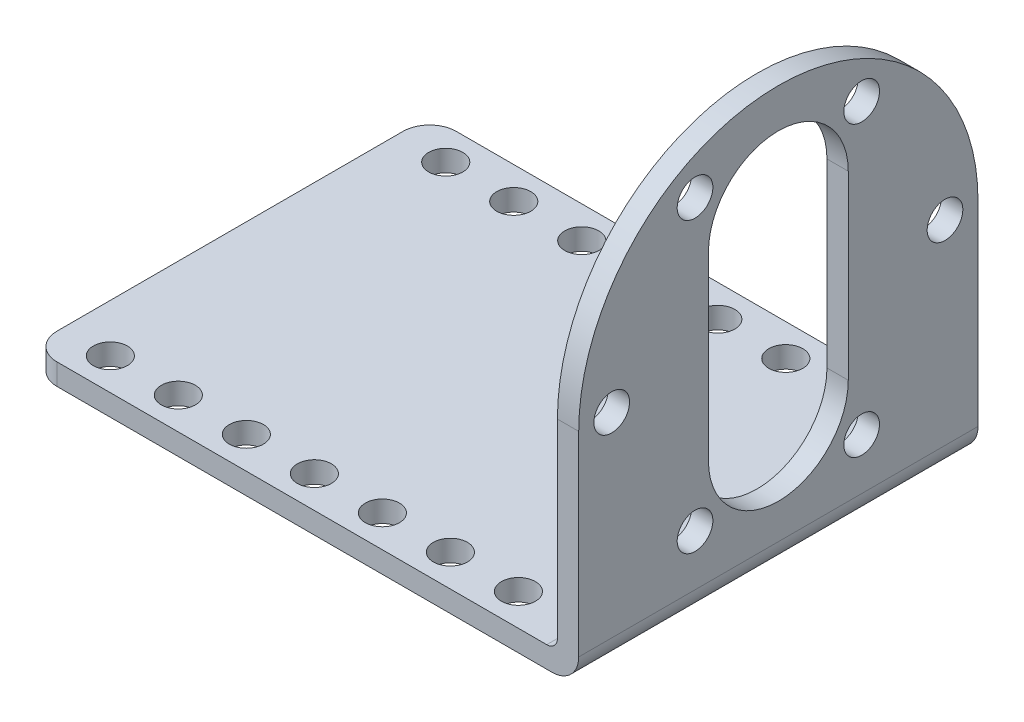
ISO-10303-21;
HEADER;
FILE_DESCRIPTION(('STEP AP214'),'2;1');
FILE_NAME('part.step','',(''),(''),'','','');
FILE_SCHEMA(('AUTOMOTIVE_DESIGN { 1 0 10303 214 1 1 1 1 }'));
ENDSEC;
DATA;
#1=APPLICATION_CONTEXT('core data for automotive mechanical design processes');
#2=APPLICATION_PROTOCOL_DEFINITION('international standard','automotive_design',2000,#1);
#3=PRODUCT_CONTEXT('',#1,'mechanical');
#4=PRODUCT('Part','Part','',(#3));
#5=PRODUCT_RELATED_PRODUCT_CATEGORY('part','',(#4));
#6=PRODUCT_DEFINITION_FORMATION('','',#4);
#7=PRODUCT_DEFINITION_CONTEXT('part definition',#1,'design');
#8=PRODUCT_DEFINITION('design','',#6,#7);
#9=PRODUCT_DEFINITION_SHAPE('','',#8);
#10=(LENGTH_UNIT() NAMED_UNIT(*) SI_UNIT(.MILLI.,.METRE.));
#11=(NAMED_UNIT(*) PLANE_ANGLE_UNIT() SI_UNIT($,.RADIAN.));
#12=(NAMED_UNIT(*) SI_UNIT($,.STERADIAN.) SOLID_ANGLE_UNIT());
#13=UNCERTAINTY_MEASURE_WITH_UNIT(LENGTH_MEASURE(1.E-05),#10,'distance_accuracy_value','');
#14=(GEOMETRIC_REPRESENTATION_CONTEXT(3) GLOBAL_UNCERTAINTY_ASSIGNED_CONTEXT((#13)) GLOBAL_UNIT_ASSIGNED_CONTEXT((#10,
#11,#12)) REPRESENTATION_CONTEXT('',''));
#15=CARTESIAN_POINT('',(0.,0.,0.));
#16=DIRECTION('',(0.,0.,1.));
#17=DIRECTION('',(1.,0.,0.));
#18=AXIS2_PLACEMENT_3D('',#15,#16,#17);
#19=CARTESIAN_POINT('',(0.,0.,0.));
#20=DIRECTION('',(1.,0.,0.));
#21=DIRECTION('',(0.,0.,-1.));
#22=AXIS2_PLACEMENT_3D('',#19,#20,#21);
#23=PLANE('',#22);
#24=DIRECTION('',(0.,-1.,0.));
#25=VECTOR('',#24,1.);
#26=CARTESIAN_POINT('',(0.,0.,-6.565));
#27=LINE('',#26,#25);
#28=CARTESIAN_POINT('',(0.,29.35,-6.565));
#29=VERTEX_POINT('',#28);
#30=CARTESIAN_POINT('',(0.,12.35,-6.565));
#31=VERTEX_POINT('',#30);
#32=EDGE_CURVE('E280',#29,#31,#27,.T.);
#33=ORIENTED_EDGE('',*,*,#32,.F.);
#34=CARTESIAN_POINT('',(0.,29.35,0.));
#35=DIRECTION('',(1.,0.,0.));
#36=DIRECTION('',(0.,0.,-1.));
#37=AXIS2_PLACEMENT_3D('',#34,#35,#36);
#38=CIRCLE('',#37,6.565);
#39=CARTESIAN_POINT('',(0.,29.35,6.565));
#40=VERTEX_POINT('',#39);
#41=EDGE_CURVE('E231',#29,#40,#38,.T.);
#42=ORIENTED_EDGE('',*,*,#41,.T.);
#43=DIRECTION('',(0.,-1.,0.));
#44=VECTOR('',#43,1.);
#45=CARTESIAN_POINT('',(0.,0.,6.565));
#46=LINE('',#45,#44);
#47=CARTESIAN_POINT('',(0.,12.35,6.565));
#48=VERTEX_POINT('',#47);
#49=EDGE_CURVE('E286',#40,#48,#46,.T.);
#50=ORIENTED_EDGE('',*,*,#49,.T.);
#51=CARTESIAN_POINT('',(0.,12.35,0.));
#52=DIRECTION('',(1.,0.,0.));
#53=DIRECTION('',(0.,0.,-1.));
#54=AXIS2_PLACEMENT_3D('',#51,#52,#53);
#55=CIRCLE('',#54,6.565);
#56=EDGE_CURVE('E283',#31,#48,#55,.F.);
#57=ORIENTED_EDGE('',*,*,#56,.F.);
#58=EDGE_LOOP('',(#33,#42,#50,#57));
#59=FACE_BOUND('',#58,.T.);
#60=CARTESIAN_POINT('',(0.,20.85,15.65));
#61=DIRECTION('',(1.,0.,0.));
#62=DIRECTION('',(0.,0.,-1.));
#63=AXIS2_PLACEMENT_3D('',#60,#61,#62);
#64=CIRCLE('',#63,1.675);
#65=CARTESIAN_POINT('',(0.,20.85,13.975));
#66=VERTEX_POINT('',#65);
#67=EDGE_CURVE('E272',#66,#66,#64,.T.);
#68=ORIENTED_EDGE('',*,*,#67,.T.);
#69=EDGE_LOOP('',(#68));
#70=FACE_BOUND('',#69,.T.);
#71=CARTESIAN_POINT('',(0.,34.4032975692265,7.82500000000001));
#72=DIRECTION('',(1.,0.,0.));
#73=DIRECTION('',(0.,0.,-1.));
#74=AXIS2_PLACEMENT_3D('',#71,#72,#73);
#75=CIRCLE('',#74,1.67499999999999);
#76=CARTESIAN_POINT('',(0.,34.4032975692265,6.15000000000001));
#77=VERTEX_POINT('',#76);
#78=EDGE_CURVE('E269',#77,#77,#75,.T.);
#79=ORIENTED_EDGE('',*,*,#78,.T.);
#80=EDGE_LOOP('',(#79));
#81=FACE_BOUND('',#80,.T.);
#82=CARTESIAN_POINT('',(0.,34.4032975692265,-7.82499999999999));
#83=DIRECTION('',(1.,0.,0.));
#84=DIRECTION('',(0.,0.,-1.));
#85=AXIS2_PLACEMENT_3D('',#82,#83,#84);
#86=CIRCLE('',#85,1.675);
#87=CARTESIAN_POINT('',(0.,34.4032975692265,-9.49999999999999));
#88=VERTEX_POINT('',#87);
#89=EDGE_CURVE('E266',#88,#88,#86,.T.);
#90=ORIENTED_EDGE('',*,*,#89,.T.);
#91=EDGE_LOOP('',(#90));
#92=FACE_BOUND('',#91,.T.);
#93=CARTESIAN_POINT('',(0.,20.85,-15.65));
#94=DIRECTION('',(1.,0.,0.));
#95=DIRECTION('',(0.,0.,-1.));
#96=AXIS2_PLACEMENT_3D('',#93,#94,#95);
#97=CIRCLE('',#96,1.675);
#98=CARTESIAN_POINT('',(0.,20.85,-17.325));
#99=VERTEX_POINT('',#98);
#100=EDGE_CURVE('E263',#99,#99,#97,.T.);
#101=ORIENTED_EDGE('',*,*,#100,.T.);
#102=EDGE_LOOP('',(#101));
#103=FACE_BOUND('',#102,.T.);
#104=CARTESIAN_POINT('',(0.,7.29670243077354,-7.82500000000001));
#105=DIRECTION('',(1.,0.,0.));
#106=DIRECTION('',(0.,0.,-1.));
#107=AXIS2_PLACEMENT_3D('',#104,#105,#106);
#108=CIRCLE('',#107,1.675);
#109=CARTESIAN_POINT('',(0.,7.29670243077354,-9.50000000000001));
#110=VERTEX_POINT('',#109);
#111=EDGE_CURVE('E260',#110,#110,#108,.T.);
#112=ORIENTED_EDGE('',*,*,#111,.T.);
#113=EDGE_LOOP('',(#112));
#114=FACE_BOUND('',#113,.T.);
#115=CARTESIAN_POINT('',(0.,7.29670243077353,7.82499999999999));
#116=DIRECTION('',(1.,0.,0.));
#117=DIRECTION('',(0.,0.,-1.));
#118=AXIS2_PLACEMENT_3D('',#115,#116,#117);
#119=CIRCLE('',#118,1.675);
#120=CARTESIAN_POINT('',(0.,7.29670243077353,6.14999999999999));
#121=VERTEX_POINT('',#120);
#122=EDGE_CURVE('E218',#121,#121,#119,.T.);
#123=ORIENTED_EDGE('',*,*,#122,.T.);
#124=EDGE_LOOP('',(#123));
#125=FACE_BOUND('',#124,.T.);
#126=DIRECTION('',(0.,1.,0.));
#127=VECTOR('',#126,1.);
#128=CARTESIAN_POINT('',(0.,1.31418445149758E-13,-18.75));
#129=LINE('',#128,#127);
#130=CARTESIAN_POINT('',(0.,3.,-18.75));
#131=VERTEX_POINT('',#130);
#132=CARTESIAN_POINT('',(0.,20.8500000000001,-18.7499999999999));
#133=VERTEX_POINT('',#132);
#134=EDGE_CURVE('E161',#131,#133,#129,.T.);
#135=ORIENTED_EDGE('',*,*,#134,.F.);
#136=DIRECTION('',(0.,0.,-1.));
#137=VECTOR('',#136,1.);
#138=CARTESIAN_POINT('',(0.,3.,0.));
#139=LINE('',#138,#137);
#140=CARTESIAN_POINT('',(0.,3.,18.75));
#141=VERTEX_POINT('',#140);
#142=EDGE_CURVE('E60',#131,#141,#139,.F.);
#143=ORIENTED_EDGE('',*,*,#142,.T.);
#144=DIRECTION('',(0.,1.,0.));
#145=VECTOR('',#144,1.);
#146=CARTESIAN_POINT('',(0.,0.,18.75));
#147=LINE('',#146,#145);
#148=CARTESIAN_POINT('',(0.,20.85,18.75));
#149=VERTEX_POINT('',#148);
#150=EDGE_CURVE('E278',#141,#149,#147,.T.);
#151=ORIENTED_EDGE('',*,*,#150,.T.);
#152=CARTESIAN_POINT('',(0.,20.85,0.));
#153=DIRECTION('',(1.,0.,0.));
#154=DIRECTION('',(0.,0.,-1.));
#155=AXIS2_PLACEMENT_3D('',#152,#153,#154);
#156=CIRCLE('',#155,18.7499999999999);
#157=EDGE_CURVE('E276',#133,#149,#156,.T.);
#158=ORIENTED_EDGE('',*,*,#157,.F.);
#159=EDGE_LOOP('',(#135,#143,#151,#158));
#160=FACE_BOUND('',#159,.T.);
#161=ADVANCED_FACE('F39',(#59,#70,#81,#92,#103,#114,#125,#160),#23,.F.);
#162=CARTESIAN_POINT('',(2.,0.,-6.565));
#163=DIRECTION('',(0.,0.,-1.));
#164=DIRECTION('',(-1.,0.,0.));
#165=AXIS2_PLACEMENT_3D('',#162,#163,#164);
#166=PLANE('',#165);
#167=ORIENTED_EDGE('',*,*,#32,.T.);
#168=DIRECTION('',(-1.,0.,0.));
#169=VECTOR('',#168,1.);
#170=CARTESIAN_POINT('',(2.,12.35,-6.565));
#171=LINE('',#170,#169);
#172=CARTESIAN_POINT('',(2.,12.35,-6.565));
#173=VERTEX_POINT('',#172);
#174=EDGE_CURVE('E174',#173,#31,#171,.T.);
#175=ORIENTED_EDGE('',*,*,#174,.F.);
#176=DIRECTION('',(0.,-1.,0.));
#177=VECTOR('',#176,1.);
#178=CARTESIAN_POINT('',(2.,0.,-6.565));
#179=LINE('',#178,#177);
#180=CARTESIAN_POINT('',(2.,29.35,-6.565));
#181=VERTEX_POINT('',#180);
#182=EDGE_CURVE('E246',#181,#173,#179,.T.);
#183=ORIENTED_EDGE('',*,*,#182,.F.);
#184=DIRECTION('',(-1.,0.,0.));
#185=VECTOR('',#184,1.);
#186=CARTESIAN_POINT('',(2.,29.35,-6.565));
#187=LINE('',#186,#185);
#188=EDGE_CURVE('E163',#181,#29,#187,.T.);
#189=ORIENTED_EDGE('',*,*,#188,.T.);
#190=EDGE_LOOP('',(#167,#175,#183,#189));
#191=FACE_BOUND('',#190,.T.);
#192=ADVANCED_FACE('F332',(#191),#166,.F.);
#193=CARTESIAN_POINT('',(2.,12.35,0.));
#194=DIRECTION('',(-1.,0.,0.));
#195=DIRECTION('',(0.,0.,1.));
#196=AXIS2_PLACEMENT_3D('',#193,#194,#195);
#197=CYLINDRICAL_SURFACE('',#196,6.565);
#198=ORIENTED_EDGE('',*,*,#56,.T.);
#199=DIRECTION('',(-1.,0.,0.));
#200=VECTOR('',#199,1.);
#201=CARTESIAN_POINT('',(2.,12.35,6.565));
#202=LINE('',#201,#200);
#203=CARTESIAN_POINT('',(2.,12.35,6.565));
#204=VERTEX_POINT('',#203);
#205=EDGE_CURVE('E292',#204,#48,#202,.T.);
#206=ORIENTED_EDGE('',*,*,#205,.F.);
#207=CARTESIAN_POINT('',(2.,12.35,0.));
#208=DIRECTION('',(1.,0.,0.));
#209=DIRECTION('',(0.,0.,-1.));
#210=AXIS2_PLACEMENT_3D('',#207,#208,#209);
#211=CIRCLE('',#210,6.565);
#212=EDGE_CURVE('E249',#173,#204,#211,.F.);
#213=ORIENTED_EDGE('',*,*,#212,.F.);
#214=ORIENTED_EDGE('',*,*,#174,.T.);
#215=EDGE_LOOP('',(#198,#206,#213,#214));
#216=FACE_BOUND('',#215,.T.);
#217=ADVANCED_FACE('F338',(#216),#197,.F.);
#218=CARTESIAN_POINT('',(2.,0.,6.565));
#219=DIRECTION('',(0.,0.,-1.));
#220=DIRECTION('',(-1.,0.,0.));
#221=AXIS2_PLACEMENT_3D('',#218,#219,#220);
#222=PLANE('',#221);
#223=ORIENTED_EDGE('',*,*,#49,.F.);
#224=DIRECTION('',(-1.,0.,0.));
#225=VECTOR('',#224,1.);
#226=CARTESIAN_POINT('',(2.,29.35,6.565));
#227=LINE('',#226,#225);
#228=CARTESIAN_POINT('',(2.,29.35,6.565));
#229=VERTEX_POINT('',#228);
#230=EDGE_CURVE('E165',#229,#40,#227,.T.);
#231=ORIENTED_EDGE('',*,*,#230,.F.);
#232=DIRECTION('',(0.,-1.,0.));
#233=VECTOR('',#232,1.);
#234=CARTESIAN_POINT('',(2.,0.,6.565));
#235=LINE('',#234,#233);
#236=EDGE_CURVE('E251',#229,#204,#235,.T.);
#237=ORIENTED_EDGE('',*,*,#236,.T.);
#238=ORIENTED_EDGE('',*,*,#205,.T.);
#239=EDGE_LOOP('',(#223,#231,#237,#238));
#240=FACE_BOUND('',#239,.T.);
#241=ADVANCED_FACE('F351',(#240),#222,.T.);
#242=CARTESIAN_POINT('',(2.,1.31418445149758E-13,-18.75));
#243=DIRECTION('',(0.,0.,1.));
#244=DIRECTION('',(0.,-1.,0.));
#245=AXIS2_PLACEMENT_3D('',#242,#243,#244);
#246=PLANE('',#245);
#247=DIRECTION('',(0.,1.,0.));
#248=VECTOR('',#247,1.);
#249=CARTESIAN_POINT('',(2.,1.31418445149758E-13,-18.75));
#250=LINE('',#249,#248);
#251=CARTESIAN_POINT('',(2.,2.50000000000011,-18.75));
#252=VERTEX_POINT('',#251);
#253=CARTESIAN_POINT('',(2.,20.8500000000001,-18.7499999999999));
#254=VERTEX_POINT('',#253);
#255=EDGE_CURVE('E138',#252,#254,#250,.T.);
#256=ORIENTED_EDGE('',*,*,#255,.F.);
#257=CARTESIAN_POINT('',(-0.5,2.50000000000011,-18.75));
#258=DIRECTION('',(0.,0.,1.));
#259=DIRECTION('',(0.,-1.,0.));
#260=AXIS2_PLACEMENT_3D('',#257,#258,#259);
#261=CIRCLE('',#260,2.5);
#262=CARTESIAN_POINT('',(-0.5,1.11022302462516E-13,-18.75));
#263=VERTEX_POINT('',#262);
#264=EDGE_CURVE('E188',#252,#263,#261,.F.);
#265=ORIENTED_EDGE('',*,*,#264,.T.);
#266=DIRECTION('',(-1.,0.,0.));
#267=VECTOR('',#266,1.);
#268=CARTESIAN_POINT('',(2.,1.11022302462516E-13,-18.75));
#269=LINE('',#268,#267);
#270=CARTESIAN_POINT('',(-47.,1.11022302462516E-13,-18.75));
#271=VERTEX_POINT('',#270);
#272=EDGE_CURVE('E257',#263,#271,#269,.T.);
#273=ORIENTED_EDGE('',*,*,#272,.T.);
#274=DIRECTION('',(0.,-1.,0.));
#275=VECTOR('',#274,1.);
#276=CARTESIAN_POINT('',(-47.,1.31418445149758E-13,-18.75));
#277=LINE('',#276,#275);
#278=CARTESIAN_POINT('',(-47.,2.,-18.7499999999998));
#279=VERTEX_POINT('',#278);
#280=EDGE_CURVE('E185',#271,#279,#277,.F.);
#281=ORIENTED_EDGE('',*,*,#280,.T.);
#282=DIRECTION('',(-1.,0.,0.));
#283=VECTOR('',#282,1.);
#284=CARTESIAN_POINT('',(0.,2.,-18.7499999999999));
#285=LINE('',#284,#283);
#286=CARTESIAN_POINT('',(-1.,2.,-18.7499999999999));
#287=VERTEX_POINT('',#286);
#288=EDGE_CURVE('E207',#287,#279,#285,.T.);
#289=ORIENTED_EDGE('',*,*,#288,.F.);
#290=CARTESIAN_POINT('',(-1.,3.,-18.75));
#291=DIRECTION('',(0.,0.,1.));
#292=DIRECTION('',(0.,-1.,0.));
#293=AXIS2_PLACEMENT_3D('',#290,#291,#292);
#294=CIRCLE('',#293,1.);
#295=EDGE_CURVE('E47',#287,#131,#294,.T.);
#296=ORIENTED_EDGE('',*,*,#295,.T.);
#297=ORIENTED_EDGE('',*,*,#134,.T.);
#298=DIRECTION('',(-1.,0.,0.));
#299=VECTOR('',#298,1.);
#300=CARTESIAN_POINT('',(2.,20.8500000000001,-18.7499999999999));
#301=LINE('',#300,#299);
#302=EDGE_CURVE('E155',#254,#133,#301,.T.);
#303=ORIENTED_EDGE('',*,*,#302,.F.);
#304=EDGE_LOOP('',(#256,#265,#273,#281,#289,#296,#297,#303));
#305=FACE_BOUND('',#304,.T.);
#306=ADVANCED_FACE('F160',(#305),#246,.F.);
#307=CARTESIAN_POINT('',(2.,20.85,0.));
#308=DIRECTION('',(-1.,0.,0.));
#309=DIRECTION('',(0.,0.,1.));
#310=AXIS2_PLACEMENT_3D('',#307,#308,#309);
#311=CYLINDRICAL_SURFACE('',#310,18.7499999999999);
#312=ORIENTED_EDGE('',*,*,#157,.T.);
#313=DIRECTION('',(-1.,0.,0.));
#314=VECTOR('',#313,1.);
#315=CARTESIAN_POINT('',(2.,20.85,18.75));
#316=LINE('',#315,#314);
#317=CARTESIAN_POINT('',(2.,20.85,18.75));
#318=VERTEX_POINT('',#317);
#319=EDGE_CURVE('E157',#318,#149,#316,.T.);
#320=ORIENTED_EDGE('',*,*,#319,.F.);
#321=CARTESIAN_POINT('',(2.,20.85,0.));
#322=DIRECTION('',(1.,0.,0.));
#323=DIRECTION('',(0.,0.,-1.));
#324=AXIS2_PLACEMENT_3D('',#321,#322,#323);
#325=CIRCLE('',#324,18.7499999999999);
#326=EDGE_CURVE('E143',#254,#318,#325,.T.);
#327=ORIENTED_EDGE('',*,*,#326,.F.);
#328=ORIENTED_EDGE('',*,*,#302,.T.);
#329=EDGE_LOOP('',(#312,#320,#327,#328));
#330=FACE_BOUND('',#329,.T.);
#331=ADVANCED_FACE('F154',(#330),#311,.T.);
#332=CARTESIAN_POINT('',(2.,0.,18.75));
#333=DIRECTION('',(0.,0.,1.));
#334=DIRECTION('',(1.,0.,0.));
#335=AXIS2_PLACEMENT_3D('',#332,#333,#334);
#336=PLANE('',#335);
#337=DIRECTION('',(-1.,0.,0.));
#338=VECTOR('',#337,1.);
#339=CARTESIAN_POINT('',(2.,-1.11022302462516E-13,18.75));
#340=LINE('',#339,#338);
#341=CARTESIAN_POINT('',(-0.5,-1.11022302462516E-13,18.75));
#342=VERTEX_POINT('',#341);
#343=CARTESIAN_POINT('',(-47.,-1.11022302462516E-13,18.75));
#344=VERTEX_POINT('',#343);
#345=EDGE_CURVE('E167',#342,#344,#340,.T.);
#346=ORIENTED_EDGE('',*,*,#345,.F.);
#347=CARTESIAN_POINT('',(-0.5,2.49999999999989,18.75));
#348=DIRECTION('',(0.,0.,1.));
#349=DIRECTION('',(1.,0.,0.));
#350=AXIS2_PLACEMENT_3D('',#347,#348,#349);
#351=CIRCLE('',#350,2.5);
#352=CARTESIAN_POINT('',(2.,2.49999999999989,18.75));
#353=VERTEX_POINT('',#352);
#354=EDGE_CURVE('E182',#342,#353,#351,.T.);
#355=ORIENTED_EDGE('',*,*,#354,.T.);
#356=DIRECTION('',(0.,1.,0.));
#357=VECTOR('',#356,1.);
#358=CARTESIAN_POINT('',(2.,0.,18.75));
#359=LINE('',#358,#357);
#360=EDGE_CURVE('E158',#353,#318,#359,.T.);
#361=ORIENTED_EDGE('',*,*,#360,.T.);
#362=ORIENTED_EDGE('',*,*,#319,.T.);
#363=ORIENTED_EDGE('',*,*,#150,.F.);
#364=CARTESIAN_POINT('',(-1.,3.,18.75));
#365=DIRECTION('',(0.,0.,1.));
#366=DIRECTION('',(1.,0.,0.));
#367=AXIS2_PLACEMENT_3D('',#364,#365,#366);
#368=CIRCLE('',#367,1.);
#369=CARTESIAN_POINT('',(-1.,2.,18.7499999999999));
#370=VERTEX_POINT('',#369);
#371=EDGE_CURVE('E11',#141,#370,#368,.F.);
#372=ORIENTED_EDGE('',*,*,#371,.T.);
#373=DIRECTION('',(1.,0.,0.));
#374=VECTOR('',#373,1.);
#375=CARTESIAN_POINT('',(0.,2.,18.7499999999999));
#376=LINE('',#375,#374);
#377=CARTESIAN_POINT('',(-47.,2.,18.7499999999998));
#378=VERTEX_POINT('',#377);
#379=EDGE_CURVE('E209',#378,#370,#376,.T.);
#380=ORIENTED_EDGE('',*,*,#379,.F.);
#381=DIRECTION('',(0.,-1.,0.));
#382=VECTOR('',#381,1.);
#383=CARTESIAN_POINT('',(-47.,0.,18.75));
#384=LINE('',#383,#382);
#385=EDGE_CURVE('E179',#378,#344,#384,.T.);
#386=ORIENTED_EDGE('',*,*,#385,.T.);
#387=EDGE_LOOP('',(#346,#355,#361,#362,#363,#372,#380,#386));
#388=FACE_BOUND('',#387,.T.);
#389=ADVANCED_FACE('F305',(#388),#336,.T.);
#390=CARTESIAN_POINT('',(2.,0.,0.));
#391=DIRECTION('',(0.,-1.,0.));
#392=DIRECTION('',(0.,0.,-1.));
#393=AXIS2_PLACEMENT_3D('',#390,#391,#392);
#394=PLANE('',#393);
#395=ORIENTED_EDGE('',*,*,#272,.F.);
#396=DIRECTION('',(0.,0.,1.));
#397=VECTOR('',#396,1.);
#398=CARTESIAN_POINT('',(-0.5,0.,0.));
#399=LINE('',#398,#397);
#400=EDGE_CURVE('E176',#263,#342,#399,.T.);
#401=ORIENTED_EDGE('',*,*,#400,.T.);
#402=ORIENTED_EDGE('',*,*,#345,.T.);
#403=CARTESIAN_POINT('',(-47.,0.,16.25));
#404=DIRECTION('',(0.,-1.,0.));
#405=DIRECTION('',(0.,0.,-1.));
#406=AXIS2_PLACEMENT_3D('',#403,#404,#405);
#407=CIRCLE('',#406,2.5);
#408=CARTESIAN_POINT('',(-49.5,0.,16.25));
#409=VERTEX_POINT('',#408);
#410=EDGE_CURVE('E171',#344,#409,#407,.T.);
#411=ORIENTED_EDGE('',*,*,#410,.T.);
#412=DIRECTION('',(0.,0.,1.));
#413=VECTOR('',#412,1.);
#414=CARTESIAN_POINT('',(-49.5,0.,-18.7499999999998));
#415=LINE('',#414,#413);
#416=CARTESIAN_POINT('',(-49.5,0.,-16.25));
#417=VERTEX_POINT('',#416);
#418=EDGE_CURVE('E220',#417,#409,#415,.T.);
#419=ORIENTED_EDGE('',*,*,#418,.F.);
#420=CARTESIAN_POINT('',(-47.,0.,-16.25));
#421=DIRECTION('',(0.,-1.,0.));
#422=DIRECTION('',(0.,0.,-1.));
#423=AXIS2_PLACEMENT_3D('',#420,#421,#422);
#424=CIRCLE('',#423,2.5);
#425=EDGE_CURVE('E173',#417,#271,#424,.T.);
#426=ORIENTED_EDGE('',*,*,#425,.T.);
#427=EDGE_LOOP('',(#395,#401,#402,#411,#419,#426));
#428=FACE_BOUND('',#427,.T.);
#429=CARTESIAN_POINT('',(-44.9875,0.,-15.75));
#430=DIRECTION('',(0.,1.,0.));
#431=DIRECTION('',(0.,0.,1.));
#432=AXIS2_PLACEMENT_3D('',#429,#430,#431);
#433=CIRCLE('',#432,1.6);
#434=CARTESIAN_POINT('',(-44.9875,0.,-14.15));
#435=VERTEX_POINT('',#434);
#436=EDGE_CURVE('E689',#435,#435,#433,.T.);
#437=ORIENTED_EDGE('',*,*,#436,.T.);
#438=EDGE_LOOP('',(#437));
#439=FACE_BOUND('',#438,.T.);
#440=CARTESIAN_POINT('',(-38.6,0.,-15.75));
#441=DIRECTION('',(0.,1.,0.));
#442=DIRECTION('',(0.,0.,1.));
#443=AXIS2_PLACEMENT_3D('',#440,#441,#442);
#444=CIRCLE('',#443,1.6);
#445=CARTESIAN_POINT('',(-38.6,0.,-14.15));
#446=VERTEX_POINT('',#445);
#447=EDGE_CURVE('E694',#446,#446,#444,.T.);
#448=ORIENTED_EDGE('',*,*,#447,.T.);
#449=EDGE_LOOP('',(#448));
#450=FACE_BOUND('',#449,.T.);
#451=CARTESIAN_POINT('',(-32.2125,0.,-15.75));
#452=DIRECTION('',(0.,1.,0.));
#453=DIRECTION('',(0.,0.,1.));
#454=AXIS2_PLACEMENT_3D('',#451,#452,#453);
#455=CIRCLE('',#454,1.59999999999999);
#456=CARTESIAN_POINT('',(-32.2125,0.,-14.15));
#457=VERTEX_POINT('',#456);
#458=EDGE_CURVE('E699',#457,#457,#455,.T.);
#459=ORIENTED_EDGE('',*,*,#458,.T.);
#460=EDGE_LOOP('',(#459));
#461=FACE_BOUND('',#460,.T.);
#462=CARTESIAN_POINT('',(-25.825,0.,-15.75));
#463=DIRECTION('',(0.,1.,0.));
#464=DIRECTION('',(0.,0.,1.));
#465=AXIS2_PLACEMENT_3D('',#462,#463,#464);
#466=CIRCLE('',#465,1.6);
#467=CARTESIAN_POINT('',(-25.825,0.,-14.15));
#468=VERTEX_POINT('',#467);
#469=EDGE_CURVE('E704',#468,#468,#466,.T.);
#470=ORIENTED_EDGE('',*,*,#469,.T.);
#471=EDGE_LOOP('',(#470));
#472=FACE_BOUND('',#471,.T.);
#473=CARTESIAN_POINT('',(-19.4375,0.,-15.75));
#474=DIRECTION('',(0.,1.,0.));
#475=DIRECTION('',(0.,0.,1.));
#476=AXIS2_PLACEMENT_3D('',#473,#474,#475);
#477=CIRCLE('',#476,1.6);
#478=CARTESIAN_POINT('',(-19.4375,0.,-14.15));
#479=VERTEX_POINT('',#478);
#480=EDGE_CURVE('E709',#479,#479,#477,.T.);
#481=ORIENTED_EDGE('',*,*,#480,.T.);
#482=EDGE_LOOP('',(#481));
#483=FACE_BOUND('',#482,.T.);
#484=CARTESIAN_POINT('',(-13.05,0.,-15.75));
#485=DIRECTION('',(0.,1.,0.));
#486=DIRECTION('',(0.,0.,1.));
#487=AXIS2_PLACEMENT_3D('',#484,#485,#486);
#488=CIRCLE('',#487,1.6);
#489=CARTESIAN_POINT('',(-13.05,0.,-14.15));
#490=VERTEX_POINT('',#489);
#491=EDGE_CURVE('E714',#490,#490,#488,.T.);
#492=ORIENTED_EDGE('',*,*,#491,.T.);
#493=EDGE_LOOP('',(#492));
#494=FACE_BOUND('',#493,.T.);
#495=CARTESIAN_POINT('',(-6.6625,0.,-15.75));
#496=DIRECTION('',(0.,1.,0.));
#497=DIRECTION('',(0.,0.,1.));
#498=AXIS2_PLACEMENT_3D('',#495,#496,#497);
#499=CIRCLE('',#498,1.6);
#500=CARTESIAN_POINT('',(-6.6625,0.,-14.15));
#501=VERTEX_POINT('',#500);
#502=EDGE_CURVE('E719',#501,#501,#499,.T.);
#503=ORIENTED_EDGE('',*,*,#502,.T.);
#504=EDGE_LOOP('',(#503));
#505=FACE_BOUND('',#504,.T.);
#506=CARTESIAN_POINT('',(-6.6625,0.,15.75));
#507=DIRECTION('',(0.,1.,0.));
#508=DIRECTION('',(0.,0.,-1.));
#509=AXIS2_PLACEMENT_3D('',#506,#507,#508);
#510=CIRCLE('',#509,1.6);
#511=CARTESIAN_POINT('',(-6.6625,0.,14.15));
#512=VERTEX_POINT('',#511);
#513=EDGE_CURVE('E724',#512,#512,#510,.T.);
#514=ORIENTED_EDGE('',*,*,#513,.T.);
#515=EDGE_LOOP('',(#514));
#516=FACE_BOUND('',#515,.T.);
#517=CARTESIAN_POINT('',(-13.05,0.,15.75));
#518=DIRECTION('',(0.,1.,0.));
#519=DIRECTION('',(0.,0.,-1.));
#520=AXIS2_PLACEMENT_3D('',#517,#518,#519);
#521=CIRCLE('',#520,1.6);
#522=CARTESIAN_POINT('',(-13.05,0.,14.15));
#523=VERTEX_POINT('',#522);
#524=EDGE_CURVE('E729',#523,#523,#521,.T.);
#525=ORIENTED_EDGE('',*,*,#524,.T.);
#526=EDGE_LOOP('',(#525));
#527=FACE_BOUND('',#526,.T.);
#528=CARTESIAN_POINT('',(-19.4375,0.,15.75));
#529=DIRECTION('',(0.,1.,0.));
#530=DIRECTION('',(0.,0.,-1.));
#531=AXIS2_PLACEMENT_3D('',#528,#529,#530);
#532=CIRCLE('',#531,1.6);
#533=CARTESIAN_POINT('',(-19.4375,0.,14.15));
#534=VERTEX_POINT('',#533);
#535=EDGE_CURVE('E734',#534,#534,#532,.T.);
#536=ORIENTED_EDGE('',*,*,#535,.T.);
#537=EDGE_LOOP('',(#536));
#538=FACE_BOUND('',#537,.T.);
#539=CARTESIAN_POINT('',(-44.9875,0.,15.75));
#540=DIRECTION('',(0.,1.,0.));
#541=DIRECTION('',(0.,0.,-1.));
#542=AXIS2_PLACEMENT_3D('',#539,#540,#541);
#543=CIRCLE('',#542,1.6);
#544=CARTESIAN_POINT('',(-44.9875,0.,14.15));
#545=VERTEX_POINT('',#544);
#546=EDGE_CURVE('E739',#545,#545,#543,.T.);
#547=ORIENTED_EDGE('',*,*,#546,.T.);
#548=EDGE_LOOP('',(#547));
#549=FACE_BOUND('',#548,.T.);
#550=CARTESIAN_POINT('',(-38.6,0.,15.75));
#551=DIRECTION('',(0.,1.,0.));
#552=DIRECTION('',(0.,0.,-1.));
#553=AXIS2_PLACEMENT_3D('',#550,#551,#552);
#554=CIRCLE('',#553,1.6);
#555=CARTESIAN_POINT('',(-38.6,0.,14.15));
#556=VERTEX_POINT('',#555);
#557=EDGE_CURVE('E744',#556,#556,#554,.T.);
#558=ORIENTED_EDGE('',*,*,#557,.T.);
#559=EDGE_LOOP('',(#558));
#560=FACE_BOUND('',#559,.T.);
#561=CARTESIAN_POINT('',(-32.2125,0.,15.75));
#562=DIRECTION('',(0.,1.,0.));
#563=DIRECTION('',(0.,0.,-1.));
#564=AXIS2_PLACEMENT_3D('',#561,#562,#563);
#565=CIRCLE('',#564,1.59999999999999);
#566=CARTESIAN_POINT('',(-32.2125,0.,14.15));
#567=VERTEX_POINT('',#566);
#568=EDGE_CURVE('E749',#567,#567,#565,.T.);
#569=ORIENTED_EDGE('',*,*,#568,.T.);
#570=EDGE_LOOP('',(#569));
#571=FACE_BOUND('',#570,.T.);
#572=CARTESIAN_POINT('',(-25.825,0.,15.75));
#573=DIRECTION('',(0.,1.,0.));
#574=DIRECTION('',(0.,0.,-1.));
#575=AXIS2_PLACEMENT_3D('',#572,#573,#574);
#576=CIRCLE('',#575,1.6);
#577=CARTESIAN_POINT('',(-25.825,0.,14.15));
#578=VERTEX_POINT('',#577);
#579=EDGE_CURVE('E754',#578,#578,#576,.T.);
#580=ORIENTED_EDGE('',*,*,#579,.T.);
#581=EDGE_LOOP('',(#580));
#582=FACE_BOUND('',#581,.T.);
#583=ADVANCED_FACE('F300',(#428,#439,#450,#461,#472,#483,#494,#505,#516,#527,#538,#549,#560,
#571,#582),#394,.T.);
#584=CARTESIAN_POINT('',(2.,20.85,15.65));
#585=DIRECTION('',(-1.,0.,0.));
#586=DIRECTION('',(0.,0.,1.));
#587=AXIS2_PLACEMENT_3D('',#584,#585,#586);
#588=CYLINDRICAL_SURFACE('',#587,1.675);
#589=CARTESIAN_POINT('',(2.,20.85,15.65));
#590=DIRECTION('',(1.,0.,0.));
#591=DIRECTION('',(0.,0.,-1.));
#592=AXIS2_PLACEMENT_3D('',#589,#590,#591);
#593=CIRCLE('',#592,1.675);
#594=CARTESIAN_POINT('',(2.,20.85,13.975));
#595=VERTEX_POINT('',#594);
#596=EDGE_CURVE('E149',#595,#595,#593,.T.);
#597=ORIENTED_EDGE('',*,*,#596,.T.);
#598=EDGE_LOOP('',(#597));
#599=FACE_BOUND('',#598,.T.);
#600=ORIENTED_EDGE('',*,*,#67,.F.);
#601=EDGE_LOOP('',(#600));
#602=FACE_BOUND('',#601,.T.);
#603=ADVANCED_FACE('F360',(#599,#602),#588,.F.);
#604=CARTESIAN_POINT('',(2.,34.4032975692265,7.82500000000001));
#605=DIRECTION('',(-1.,0.,0.));
#606=DIRECTION('',(0.,0.,1.));
#607=AXIS2_PLACEMENT_3D('',#604,#605,#606);
#608=CYLINDRICAL_SURFACE('',#607,1.67499999999999);
#609=CARTESIAN_POINT('',(2.,34.4032975692265,7.82500000000001));
#610=DIRECTION('',(1.,0.,0.));
#611=DIRECTION('',(0.,0.,-1.));
#612=AXIS2_PLACEMENT_3D('',#609,#610,#611);
#613=CIRCLE('',#612,1.67499999999999);
#614=CARTESIAN_POINT('',(2.,34.4032975692265,6.15000000000001));
#615=VERTEX_POINT('',#614);
#616=EDGE_CURVE('E240',#615,#615,#613,.T.);
#617=ORIENTED_EDGE('',*,*,#616,.T.);
#618=EDGE_LOOP('',(#617));
#619=FACE_BOUND('',#618,.T.);
#620=ORIENTED_EDGE('',*,*,#78,.F.);
#621=EDGE_LOOP('',(#620));
#622=FACE_BOUND('',#621,.T.);
#623=ADVANCED_FACE('F369',(#619,#622),#608,.F.);
#624=CARTESIAN_POINT('',(2.,34.4032975692265,-7.82499999999999));
#625=DIRECTION('',(-1.,0.,0.));
#626=DIRECTION('',(0.,0.,1.));
#627=AXIS2_PLACEMENT_3D('',#624,#625,#626);
#628=CYLINDRICAL_SURFACE('',#627,1.675);
#629=CARTESIAN_POINT('',(2.,34.4032975692265,-7.82499999999999));
#630=DIRECTION('',(1.,0.,0.));
#631=DIRECTION('',(0.,0.,-1.));
#632=AXIS2_PLACEMENT_3D('',#629,#630,#631);
#633=CIRCLE('',#632,1.675);
#634=CARTESIAN_POINT('',(2.,34.4032975692265,-9.49999999999999));
#635=VERTEX_POINT('',#634);
#636=EDGE_CURVE('E237',#635,#635,#633,.T.);
#637=ORIENTED_EDGE('',*,*,#636,.T.);
#638=EDGE_LOOP('',(#637));
#639=FACE_BOUND('',#638,.T.);
#640=ORIENTED_EDGE('',*,*,#89,.F.);
#641=EDGE_LOOP('',(#640));
#642=FACE_BOUND('',#641,.T.);
#643=ADVANCED_FACE('F373',(#639,#642),#628,.F.);
#644=CARTESIAN_POINT('',(2.,20.85,-15.65));
#645=DIRECTION('',(-1.,0.,0.));
#646=DIRECTION('',(0.,0.,1.));
#647=AXIS2_PLACEMENT_3D('',#644,#645,#646);
#648=CYLINDRICAL_SURFACE('',#647,1.675);
#649=CARTESIAN_POINT('',(2.,20.85,-15.65));
#650=DIRECTION('',(1.,0.,0.));
#651=DIRECTION('',(0.,0.,-1.));
#652=AXIS2_PLACEMENT_3D('',#649,#650,#651);
#653=CIRCLE('',#652,1.675);
#654=CARTESIAN_POINT('',(2.,20.85,-17.325));
#655=VERTEX_POINT('',#654);
#656=EDGE_CURVE('E234',#655,#655,#653,.T.);
#657=ORIENTED_EDGE('',*,*,#656,.T.);
#658=EDGE_LOOP('',(#657));
#659=FACE_BOUND('',#658,.T.);
#660=ORIENTED_EDGE('',*,*,#100,.F.);
#661=EDGE_LOOP('',(#660));
#662=FACE_BOUND('',#661,.T.);
#663=ADVANCED_FACE('F377',(#659,#662),#648,.F.);
#664=CARTESIAN_POINT('',(2.,7.29670243077354,-7.82500000000001));
#665=DIRECTION('',(-1.,0.,0.));
#666=DIRECTION('',(0.,0.,1.));
#667=AXIS2_PLACEMENT_3D('',#664,#665,#666);
#668=CYLINDRICAL_SURFACE('',#667,1.675);
#669=CARTESIAN_POINT('',(2.,7.29670243077354,-7.82500000000001));
#670=DIRECTION('',(1.,0.,0.));
#671=DIRECTION('',(0.,0.,-1.));
#672=AXIS2_PLACEMENT_3D('',#669,#670,#671);
#673=CIRCLE('',#672,1.675);
#674=CARTESIAN_POINT('',(2.,7.29670243077354,-9.50000000000001));
#675=VERTEX_POINT('',#674);
#676=EDGE_CURVE('E230',#675,#675,#673,.T.);
#677=ORIENTED_EDGE('',*,*,#676,.T.);
#678=EDGE_LOOP('',(#677));
#679=FACE_BOUND('',#678,.T.);
#680=ORIENTED_EDGE('',*,*,#111,.F.);
#681=EDGE_LOOP('',(#680));
#682=FACE_BOUND('',#681,.T.);
#683=ADVANCED_FACE('F381',(#679,#682),#668,.F.);
#684=CARTESIAN_POINT('',(2.,7.29670243077353,7.82499999999999));
#685=DIRECTION('',(-1.,0.,0.));
#686=DIRECTION('',(0.,0.,1.));
#687=AXIS2_PLACEMENT_3D('',#684,#685,#686);
#688=CYLINDRICAL_SURFACE('',#687,1.675);
#689=CARTESIAN_POINT('',(2.,7.29670243077353,7.82499999999999));
#690=DIRECTION('',(1.,0.,0.));
#691=DIRECTION('',(0.,0.,-1.));
#692=AXIS2_PLACEMENT_3D('',#689,#690,#691);
#693=CIRCLE('',#692,1.675);
#694=CARTESIAN_POINT('',(2.,7.29670243077353,6.14999999999999));
#695=VERTEX_POINT('',#694);
#696=EDGE_CURVE('E227',#695,#695,#693,.T.);
#697=ORIENTED_EDGE('',*,*,#696,.T.);
#698=EDGE_LOOP('',(#697));
#699=FACE_BOUND('',#698,.T.);
#700=ORIENTED_EDGE('',*,*,#122,.F.);
#701=EDGE_LOOP('',(#700));
#702=FACE_BOUND('',#701,.T.);
#703=ADVANCED_FACE('F349',(#699,#702),#688,.F.);
#704=CARTESIAN_POINT('',(2.,29.35,0.));
#705=DIRECTION('',(-1.,0.,0.));
#706=DIRECTION('',(0.,0.,1.));
#707=AXIS2_PLACEMENT_3D('',#704,#705,#706);
#708=CYLINDRICAL_SURFACE('',#707,6.565);
#709=ORIENTED_EDGE('',*,*,#41,.F.);
#710=ORIENTED_EDGE('',*,*,#188,.F.);
#711=CARTESIAN_POINT('',(2.,29.35,0.));
#712=DIRECTION('',(1.,0.,0.));
#713=DIRECTION('',(0.,0.,-1.));
#714=AXIS2_PLACEMENT_3D('',#711,#712,#713);
#715=CIRCLE('',#714,6.565);
#716=EDGE_CURVE('E254',#181,#229,#715,.T.);
#717=ORIENTED_EDGE('',*,*,#716,.T.);
#718=ORIENTED_EDGE('',*,*,#230,.T.);
#719=EDGE_LOOP('',(#709,#710,#717,#718));
#720=FACE_BOUND('',#719,.T.);
#721=ADVANCED_FACE('F346',(#720),#708,.F.);
#722=CARTESIAN_POINT('',(2.,0.,0.));
#723=DIRECTION('',(1.,0.,0.));
#724=DIRECTION('',(0.,0.,-1.));
#725=AXIS2_PLACEMENT_3D('',#722,#723,#724);
#726=PLANE('',#725);
#727=ORIENTED_EDGE('',*,*,#696,.F.);
#728=EDGE_LOOP('',(#727));
#729=FACE_BOUND('',#728,.T.);
#730=ORIENTED_EDGE('',*,*,#676,.F.);
#731=EDGE_LOOP('',(#730));
#732=FACE_BOUND('',#731,.T.);
#733=ORIENTED_EDGE('',*,*,#656,.F.);
#734=EDGE_LOOP('',(#733));
#735=FACE_BOUND('',#734,.T.);
#736=ORIENTED_EDGE('',*,*,#636,.F.);
#737=EDGE_LOOP('',(#736));
#738=FACE_BOUND('',#737,.T.);
#739=ORIENTED_EDGE('',*,*,#616,.F.);
#740=EDGE_LOOP('',(#739));
#741=FACE_BOUND('',#740,.T.);
#742=ORIENTED_EDGE('',*,*,#596,.F.);
#743=EDGE_LOOP('',(#742));
#744=FACE_BOUND('',#743,.T.);
#745=ORIENTED_EDGE('',*,*,#360,.F.);
#746=DIRECTION('',(0.,0.,1.));
#747=VECTOR('',#746,1.);
#748=CARTESIAN_POINT('',(2.,2.5,0.));
#749=LINE('',#748,#747);
#750=EDGE_CURVE('E146',#353,#252,#749,.F.);
#751=ORIENTED_EDGE('',*,*,#750,.T.);
#752=ORIENTED_EDGE('',*,*,#255,.T.);
#753=ORIENTED_EDGE('',*,*,#326,.T.);
#754=EDGE_LOOP('',(#745,#751,#752,#753));
#755=FACE_BOUND('',#754,.T.);
#756=ORIENTED_EDGE('',*,*,#182,.T.);
#757=ORIENTED_EDGE('',*,*,#212,.T.);
#758=ORIENTED_EDGE('',*,*,#236,.F.);
#759=ORIENTED_EDGE('',*,*,#716,.F.);
#760=EDGE_LOOP('',(#756,#757,#758,#759));
#761=FACE_BOUND('',#760,.T.);
#762=ADVANCED_FACE('F141',(#729,#732,#735,#738,#741,#744,#755,#761),#726,.T.);
#763=CARTESIAN_POINT('',(0.,2.,0.));
#764=DIRECTION('',(0.,1.,0.));
#765=DIRECTION('',(0.,0.,1.));
#766=AXIS2_PLACEMENT_3D('',#763,#764,#765);
#767=PLANE('',#766);
#768=CARTESIAN_POINT('',(-32.2125,2.,15.75));
#769=DIRECTION('',(0.,1.,0.));
#770=DIRECTION('',(0.,0.,-1.));
#771=AXIS2_PLACEMENT_3D('',#768,#769,#770);
#772=CIRCLE('',#771,1.59999999999999);
#773=CARTESIAN_POINT('',(-32.2125,2.,14.15));
#774=VERTEX_POINT('',#773);
#775=EDGE_CURVE('E666',#774,#774,#772,.T.);
#776=ORIENTED_EDGE('',*,*,#775,.F.);
#777=EDGE_LOOP('',(#776));
#778=FACE_BOUND('',#777,.T.);
#779=CARTESIAN_POINT('',(-44.9875,2.,15.75));
#780=DIRECTION('',(0.,1.,0.));
#781=DIRECTION('',(0.,0.,-1.));
#782=AXIS2_PLACEMENT_3D('',#779,#780,#781);
#783=CIRCLE('',#782,1.6);
#784=CARTESIAN_POINT('',(-44.9875,2.,14.15));
#785=VERTEX_POINT('',#784);
#786=EDGE_CURVE('E670',#785,#785,#783,.T.);
#787=ORIENTED_EDGE('',*,*,#786,.F.);
#788=EDGE_LOOP('',(#787));
#789=FACE_BOUND('',#788,.T.);
#790=CARTESIAN_POINT('',(-13.05,2.,15.75));
#791=DIRECTION('',(0.,1.,0.));
#792=DIRECTION('',(0.,0.,-1.));
#793=AXIS2_PLACEMENT_3D('',#790,#791,#792);
#794=CIRCLE('',#793,1.6);
#795=CARTESIAN_POINT('',(-13.05,2.,14.15));
#796=VERTEX_POINT('',#795);
#797=EDGE_CURVE('E674',#796,#796,#794,.T.);
#798=ORIENTED_EDGE('',*,*,#797,.F.);
#799=EDGE_LOOP('',(#798));
#800=FACE_BOUND('',#799,.T.);
#801=CARTESIAN_POINT('',(-6.6625,2.,-15.75));
#802=DIRECTION('',(0.,1.,0.));
#803=DIRECTION('',(0.,0.,1.));
#804=AXIS2_PLACEMENT_3D('',#801,#802,#803);
#805=CIRCLE('',#804,1.6);
#806=CARTESIAN_POINT('',(-6.6625,2.,-14.15));
#807=VERTEX_POINT('',#806);
#808=EDGE_CURVE('E678',#807,#807,#805,.T.);
#809=ORIENTED_EDGE('',*,*,#808,.F.);
#810=EDGE_LOOP('',(#809));
#811=FACE_BOUND('',#810,.T.);
#812=CARTESIAN_POINT('',(-19.4375,2.,-15.75));
#813=DIRECTION('',(0.,1.,0.));
#814=DIRECTION('',(0.,0.,1.));
#815=AXIS2_PLACEMENT_3D('',#812,#813,#814);
#816=CIRCLE('',#815,1.6);
#817=CARTESIAN_POINT('',(-19.4375,2.,-14.15));
#818=VERTEX_POINT('',#817);
#819=EDGE_CURVE('E682',#818,#818,#816,.T.);
#820=ORIENTED_EDGE('',*,*,#819,.F.);
#821=EDGE_LOOP('',(#820));
#822=FACE_BOUND('',#821,.T.);
#823=CARTESIAN_POINT('',(-32.2125,2.,-15.75));
#824=DIRECTION('',(0.,1.,0.));
#825=DIRECTION('',(0.,0.,1.));
#826=AXIS2_PLACEMENT_3D('',#823,#824,#825);
#827=CIRCLE('',#826,1.59999999999999);
#828=CARTESIAN_POINT('',(-32.2125,2.,-14.15));
#829=VERTEX_POINT('',#828);
#830=EDGE_CURVE('E686',#829,#829,#827,.T.);
#831=ORIENTED_EDGE('',*,*,#830,.F.);
#832=EDGE_LOOP('',(#831));
#833=FACE_BOUND('',#832,.T.);
#834=CARTESIAN_POINT('',(-44.9875,2.,-15.75));
#835=DIRECTION('',(0.,1.,0.));
#836=DIRECTION('',(0.,0.,1.));
#837=AXIS2_PLACEMENT_3D('',#834,#835,#836);
#838=CIRCLE('',#837,1.6);
#839=CARTESIAN_POINT('',(-44.9875,2.,-14.15));
#840=VERTEX_POINT('',#839);
#841=EDGE_CURVE('E226',#840,#840,#838,.T.);
#842=ORIENTED_EDGE('',*,*,#841,.F.);
#843=EDGE_LOOP('',(#842));
#844=FACE_BOUND('',#843,.T.);
#845=ORIENTED_EDGE('',*,*,#379,.T.);
#846=DIRECTION('',(0.,0.,-1.));
#847=VECTOR('',#846,1.);
#848=CARTESIAN_POINT('',(-1.,2.,0.));
#849=LINE('',#848,#847);
#850=EDGE_CURVE('E199',#370,#287,#849,.T.);
#851=ORIENTED_EDGE('',*,*,#850,.T.);
#852=ORIENTED_EDGE('',*,*,#288,.T.);
#853=CARTESIAN_POINT('',(-47.,2.,-16.25));
#854=DIRECTION('',(0.,1.,0.));
#855=DIRECTION('',(0.,0.,1.));
#856=AXIS2_PLACEMENT_3D('',#853,#854,#855);
#857=CIRCLE('',#856,2.5);
#858=CARTESIAN_POINT('',(-49.5,2.,-16.25));
#859=VERTEX_POINT('',#858);
#860=EDGE_CURVE('E197',#279,#859,#857,.T.);
#861=ORIENTED_EDGE('',*,*,#860,.T.);
#862=DIRECTION('',(0.,0.,1.));
#863=VECTOR('',#862,1.);
#864=CARTESIAN_POINT('',(-49.5,2.,-18.7499999999998));
#865=LINE('',#864,#863);
#866=CARTESIAN_POINT('',(-49.5,2.,16.25));
#867=VERTEX_POINT('',#866);
#868=EDGE_CURVE('E215',#859,#867,#865,.T.);
#869=ORIENTED_EDGE('',*,*,#868,.T.);
#870=CARTESIAN_POINT('',(-47.,2.,16.25));
#871=DIRECTION('',(0.,1.,0.));
#872=DIRECTION('',(0.,0.,1.));
#873=AXIS2_PLACEMENT_3D('',#870,#871,#872);
#874=CIRCLE('',#873,2.5);
#875=EDGE_CURVE('E195',#867,#378,#874,.T.);
#876=ORIENTED_EDGE('',*,*,#875,.T.);
#877=EDGE_LOOP('',(#845,#851,#852,#861,#869,#876));
#878=FACE_BOUND('',#877,.T.);
#879=CARTESIAN_POINT('',(-38.6,2.,-15.75));
#880=DIRECTION('',(0.,1.,0.));
#881=DIRECTION('',(0.,0.,1.));
#882=AXIS2_PLACEMENT_3D('',#879,#880,#881);
#883=CIRCLE('',#882,1.6);
#884=CARTESIAN_POINT('',(-38.6,2.,-14.15));
#885=VERTEX_POINT('',#884);
#886=EDGE_CURVE('E692',#885,#885,#883,.T.);
#887=ORIENTED_EDGE('',*,*,#886,.F.);
#888=EDGE_LOOP('',(#887));
#889=FACE_BOUND('',#888,.T.);
#890=CARTESIAN_POINT('',(-25.825,2.,-15.75));
#891=DIRECTION('',(0.,1.,0.));
#892=DIRECTION('',(0.,0.,1.));
#893=AXIS2_PLACEMENT_3D('',#890,#891,#892);
#894=CIRCLE('',#893,1.6);
#895=CARTESIAN_POINT('',(-25.825,2.,-14.15));
#896=VERTEX_POINT('',#895);
#897=EDGE_CURVE('E702',#896,#896,#894,.T.);
#898=ORIENTED_EDGE('',*,*,#897,.F.);
#899=EDGE_LOOP('',(#898));
#900=FACE_BOUND('',#899,.T.);
#901=CARTESIAN_POINT('',(-13.05,2.,-15.75));
#902=DIRECTION('',(0.,1.,0.));
#903=DIRECTION('',(0.,0.,1.));
#904=AXIS2_PLACEMENT_3D('',#901,#902,#903);
#905=CIRCLE('',#904,1.6);
#906=CARTESIAN_POINT('',(-13.05,2.,-14.15));
#907=VERTEX_POINT('',#906);
#908=EDGE_CURVE('E712',#907,#907,#905,.T.);
#909=ORIENTED_EDGE('',*,*,#908,.F.);
#910=EDGE_LOOP('',(#909));
#911=FACE_BOUND('',#910,.T.);
#912=CARTESIAN_POINT('',(-6.6625,2.,15.75));
#913=DIRECTION('',(0.,1.,0.));
#914=DIRECTION('',(0.,0.,-1.));
#915=AXIS2_PLACEMENT_3D('',#912,#913,#914);
#916=CIRCLE('',#915,1.6);
#917=CARTESIAN_POINT('',(-6.6625,2.,14.15));
#918=VERTEX_POINT('',#917);
#919=EDGE_CURVE('E722',#918,#918,#916,.T.);
#920=ORIENTED_EDGE('',*,*,#919,.F.);
#921=EDGE_LOOP('',(#920));
#922=FACE_BOUND('',#921,.T.);
#923=CARTESIAN_POINT('',(-19.4375,2.,15.75));
#924=DIRECTION('',(0.,1.,0.));
#925=DIRECTION('',(0.,0.,-1.));
#926=AXIS2_PLACEMENT_3D('',#923,#924,#925);
#927=CIRCLE('',#926,1.6);
#928=CARTESIAN_POINT('',(-19.4375,2.,14.15));
#929=VERTEX_POINT('',#928);
#930=EDGE_CURVE('E732',#929,#929,#927,.T.);
#931=ORIENTED_EDGE('',*,*,#930,.F.);
#932=EDGE_LOOP('',(#931));
#933=FACE_BOUND('',#932,.T.);
#934=CARTESIAN_POINT('',(-38.6,2.,15.75));
#935=DIRECTION('',(0.,1.,0.));
#936=DIRECTION('',(0.,0.,-1.));
#937=AXIS2_PLACEMENT_3D('',#934,#935,#936);
#938=CIRCLE('',#937,1.6);
#939=CARTESIAN_POINT('',(-38.6,2.,14.15));
#940=VERTEX_POINT('',#939);
#941=EDGE_CURVE('E742',#940,#940,#938,.T.);
#942=ORIENTED_EDGE('',*,*,#941,.F.);
#943=EDGE_LOOP('',(#942));
#944=FACE_BOUND('',#943,.T.);
#945=CARTESIAN_POINT('',(-25.825,2.,15.75));
#946=DIRECTION('',(0.,1.,0.));
#947=DIRECTION('',(0.,0.,-1.));
#948=AXIS2_PLACEMENT_3D('',#945,#946,#947);
#949=CIRCLE('',#948,1.6);
#950=CARTESIAN_POINT('',(-25.825,2.,14.15));
#951=VERTEX_POINT('',#950);
#952=EDGE_CURVE('E752',#951,#951,#949,.T.);
#953=ORIENTED_EDGE('',*,*,#952,.F.);
#954=EDGE_LOOP('',(#953));
#955=FACE_BOUND('',#954,.T.);
#956=ADVANCED_FACE('F205',(#778,#789,#800,#811,#822,#833,#844,#878,#889,#900,#911,#922,#933,
#944,#955),#767,.T.);
#957=CARTESIAN_POINT('',(-49.5,2.,-18.7499999999998));
#958=DIRECTION('',(1.,0.,0.));
#959=DIRECTION('',(0.,0.,-1.));
#960=AXIS2_PLACEMENT_3D('',#957,#958,#959);
#961=PLANE('',#960);
#962=ORIENTED_EDGE('',*,*,#868,.F.);
#963=DIRECTION('',(0.,-1.,0.));
#964=VECTOR('',#963,1.);
#965=CARTESIAN_POINT('',(-49.5,1.99999999999998,-16.25));
#966=LINE('',#965,#964);
#967=EDGE_CURVE('E192',#859,#417,#966,.T.);
#968=ORIENTED_EDGE('',*,*,#967,.T.);
#969=ORIENTED_EDGE('',*,*,#418,.T.);
#970=DIRECTION('',(0.,-1.,0.));
#971=VECTOR('',#970,1.);
#972=CARTESIAN_POINT('',(-49.5,2.,16.25));
#973=LINE('',#972,#971);
#974=EDGE_CURVE('E190',#409,#867,#973,.F.);
#975=ORIENTED_EDGE('',*,*,#974,.T.);
#976=EDGE_LOOP('',(#962,#968,#969,#975));
#977=FACE_BOUND('',#976,.T.);
#978=ADVANCED_FACE('F313',(#977),#961,.F.);
#979=CARTESIAN_POINT('',(-44.9875,2.,-15.75));
#980=DIRECTION('',(0.,-1.,0.));
#981=DIRECTION('',(0.,0.,-1.));
#982=AXIS2_PLACEMENT_3D('',#979,#980,#981);
#983=CYLINDRICAL_SURFACE('',#982,1.6);
#984=ORIENTED_EDGE('',*,*,#841,.T.);
#985=EDGE_LOOP('',(#984));
#986=FACE_BOUND('',#985,.T.);
#987=ORIENTED_EDGE('',*,*,#436,.F.);
#988=EDGE_LOOP('',(#987));
#989=FACE_BOUND('',#988,.T.);
#990=ADVANCED_FACE('F417',(#986,#989),#983,.F.);
#991=CARTESIAN_POINT('',(-38.6,2.,-15.75));
#992=DIRECTION('',(0.,-1.,0.));
#993=DIRECTION('',(0.,0.,-1.));
#994=AXIS2_PLACEMENT_3D('',#991,#992,#993);
#995=CYLINDRICAL_SURFACE('',#994,1.6);
#996=ORIENTED_EDGE('',*,*,#886,.T.);
#997=EDGE_LOOP('',(#996));
#998=FACE_BOUND('',#997,.T.);
#999=ORIENTED_EDGE('',*,*,#447,.F.);
#1000=EDGE_LOOP('',(#999));
#1001=FACE_BOUND('',#1000,.T.);
#1002=ADVANCED_FACE('F552',(#998,#1001),#995,.F.);
#1003=CARTESIAN_POINT('',(-32.2125,2.,-15.75));
#1004=DIRECTION('',(0.,-1.,0.));
#1005=DIRECTION('',(0.,0.,-1.));
#1006=AXIS2_PLACEMENT_3D('',#1003,#1004,#1005);
#1007=CYLINDRICAL_SURFACE('',#1006,1.59999999999999);
#1008=ORIENTED_EDGE('',*,*,#830,.T.);
#1009=EDGE_LOOP('',(#1008));
#1010=FACE_BOUND('',#1009,.T.);
#1011=ORIENTED_EDGE('',*,*,#458,.F.);
#1012=EDGE_LOOP('',(#1011));
#1013=FACE_BOUND('',#1012,.T.);
#1014=ADVANCED_FACE('F542',(#1010,#1013),#1007,.F.);
#1015=CARTESIAN_POINT('',(-25.825,2.,-15.75));
#1016=DIRECTION('',(0.,-1.,0.));
#1017=DIRECTION('',(0.,0.,-1.));
#1018=AXIS2_PLACEMENT_3D('',#1015,#1016,#1017);
#1019=CYLINDRICAL_SURFACE('',#1018,1.6);
#1020=ORIENTED_EDGE('',*,*,#897,.T.);
#1021=EDGE_LOOP('',(#1020));
#1022=FACE_BOUND('',#1021,.T.);
#1023=ORIENTED_EDGE('',*,*,#469,.F.);
#1024=EDGE_LOOP('',(#1023));
#1025=FACE_BOUND('',#1024,.T.);
#1026=ADVANCED_FACE('F532',(#1022,#1025),#1019,.F.);
#1027=CARTESIAN_POINT('',(-19.4375,2.,-15.75));
#1028=DIRECTION('',(0.,-1.,0.));
#1029=DIRECTION('',(0.,0.,-1.));
#1030=AXIS2_PLACEMENT_3D('',#1027,#1028,#1029);
#1031=CYLINDRICAL_SURFACE('',#1030,1.6);
#1032=ORIENTED_EDGE('',*,*,#819,.T.);
#1033=EDGE_LOOP('',(#1032));
#1034=FACE_BOUND('',#1033,.T.);
#1035=ORIENTED_EDGE('',*,*,#480,.F.);
#1036=EDGE_LOOP('',(#1035));
#1037=FACE_BOUND('',#1036,.T.);
#1038=ADVANCED_FACE('F522',(#1034,#1037),#1031,.F.);
#1039=CARTESIAN_POINT('',(-13.05,2.,-15.75));
#1040=DIRECTION('',(0.,-1.,0.));
#1041=DIRECTION('',(0.,0.,-1.));
#1042=AXIS2_PLACEMENT_3D('',#1039,#1040,#1041);
#1043=CYLINDRICAL_SURFACE('',#1042,1.6);
#1044=ORIENTED_EDGE('',*,*,#908,.T.);
#1045=EDGE_LOOP('',(#1044));
#1046=FACE_BOUND('',#1045,.T.);
#1047=ORIENTED_EDGE('',*,*,#491,.F.);
#1048=EDGE_LOOP('',(#1047));
#1049=FACE_BOUND('',#1048,.T.);
#1050=ADVANCED_FACE('F512',(#1046,#1049),#1043,.F.);
#1051=CARTESIAN_POINT('',(-6.6625,2.,-15.75));
#1052=DIRECTION('',(0.,-1.,0.));
#1053=DIRECTION('',(0.,0.,-1.));
#1054=AXIS2_PLACEMENT_3D('',#1051,#1052,#1053);
#1055=CYLINDRICAL_SURFACE('',#1054,1.6);
#1056=ORIENTED_EDGE('',*,*,#808,.T.);
#1057=EDGE_LOOP('',(#1056));
#1058=FACE_BOUND('',#1057,.T.);
#1059=ORIENTED_EDGE('',*,*,#502,.F.);
#1060=EDGE_LOOP('',(#1059));
#1061=FACE_BOUND('',#1060,.T.);
#1062=ADVANCED_FACE('F502',(#1058,#1061),#1055,.F.);
#1063=CARTESIAN_POINT('',(-6.6625,2.,15.75));
#1064=DIRECTION('',(0.,-1.,0.));
#1065=DIRECTION('',(0.,0.,-1.));
#1066=AXIS2_PLACEMENT_3D('',#1063,#1064,#1065);
#1067=CYLINDRICAL_SURFACE('',#1066,1.6);
#1068=ORIENTED_EDGE('',*,*,#919,.T.);
#1069=EDGE_LOOP('',(#1068));
#1070=FACE_BOUND('',#1069,.T.);
#1071=ORIENTED_EDGE('',*,*,#513,.F.);
#1072=EDGE_LOOP('',(#1071));
#1073=FACE_BOUND('',#1072,.T.);
#1074=ADVANCED_FACE('F492',(#1070,#1073),#1067,.F.);
#1075=CARTESIAN_POINT('',(-13.05,2.,15.75));
#1076=DIRECTION('',(0.,-1.,0.));
#1077=DIRECTION('',(0.,0.,-1.));
#1078=AXIS2_PLACEMENT_3D('',#1075,#1076,#1077);
#1079=CYLINDRICAL_SURFACE('',#1078,1.6);
#1080=ORIENTED_EDGE('',*,*,#797,.T.);
#1081=EDGE_LOOP('',(#1080));
#1082=FACE_BOUND('',#1081,.T.);
#1083=ORIENTED_EDGE('',*,*,#524,.F.);
#1084=EDGE_LOOP('',(#1083));
#1085=FACE_BOUND('',#1084,.T.);
#1086=ADVANCED_FACE('F482',(#1082,#1085),#1079,.F.);
#1087=CARTESIAN_POINT('',(-19.4375,2.,15.75));
#1088=DIRECTION('',(0.,-1.,0.));
#1089=DIRECTION('',(0.,0.,-1.));
#1090=AXIS2_PLACEMENT_3D('',#1087,#1088,#1089);
#1091=CYLINDRICAL_SURFACE('',#1090,1.6);
#1092=ORIENTED_EDGE('',*,*,#930,.T.);
#1093=EDGE_LOOP('',(#1092));
#1094=FACE_BOUND('',#1093,.T.);
#1095=ORIENTED_EDGE('',*,*,#535,.F.);
#1096=EDGE_LOOP('',(#1095));
#1097=FACE_BOUND('',#1096,.T.);
#1098=ADVANCED_FACE('F472',(#1094,#1097),#1091,.F.);
#1099=CARTESIAN_POINT('',(-44.9875,2.,15.75));
#1100=DIRECTION('',(0.,-1.,0.));
#1101=DIRECTION('',(0.,0.,-1.));
#1102=AXIS2_PLACEMENT_3D('',#1099,#1100,#1101);
#1103=CYLINDRICAL_SURFACE('',#1102,1.6);
#1104=ORIENTED_EDGE('',*,*,#786,.T.);
#1105=EDGE_LOOP('',(#1104));
#1106=FACE_BOUND('',#1105,.T.);
#1107=ORIENTED_EDGE('',*,*,#546,.F.);
#1108=EDGE_LOOP('',(#1107));
#1109=FACE_BOUND('',#1108,.T.);
#1110=ADVANCED_FACE('F462',(#1106,#1109),#1103,.F.);
#1111=CARTESIAN_POINT('',(-38.6,2.,15.75));
#1112=DIRECTION('',(0.,-1.,0.));
#1113=DIRECTION('',(0.,0.,-1.));
#1114=AXIS2_PLACEMENT_3D('',#1111,#1112,#1113);
#1115=CYLINDRICAL_SURFACE('',#1114,1.6);
#1116=ORIENTED_EDGE('',*,*,#941,.T.);
#1117=EDGE_LOOP('',(#1116));
#1118=FACE_BOUND('',#1117,.T.);
#1119=ORIENTED_EDGE('',*,*,#557,.F.);
#1120=EDGE_LOOP('',(#1119));
#1121=FACE_BOUND('',#1120,.T.);
#1122=ADVANCED_FACE('F452',(#1118,#1121),#1115,.F.);
#1123=CARTESIAN_POINT('',(-32.2125,2.,15.75));
#1124=DIRECTION('',(0.,-1.,0.));
#1125=DIRECTION('',(0.,0.,-1.));
#1126=AXIS2_PLACEMENT_3D('',#1123,#1124,#1125);
#1127=CYLINDRICAL_SURFACE('',#1126,1.59999999999999);
#1128=ORIENTED_EDGE('',*,*,#775,.T.);
#1129=EDGE_LOOP('',(#1128));
#1130=FACE_BOUND('',#1129,.T.);
#1131=ORIENTED_EDGE('',*,*,#568,.F.);
#1132=EDGE_LOOP('',(#1131));
#1133=FACE_BOUND('',#1132,.T.);
#1134=ADVANCED_FACE('F327',(#1130,#1133),#1127,.F.);
#1135=CARTESIAN_POINT('',(-25.825,2.,15.75));
#1136=DIRECTION('',(0.,-1.,0.));
#1137=DIRECTION('',(0.,0.,-1.));
#1138=AXIS2_PLACEMENT_3D('',#1135,#1136,#1137);
#1139=CYLINDRICAL_SURFACE('',#1138,1.6);
#1140=ORIENTED_EDGE('',*,*,#952,.T.);
#1141=EDGE_LOOP('',(#1140));
#1142=FACE_BOUND('',#1141,.T.);
#1143=ORIENTED_EDGE('',*,*,#579,.F.);
#1144=EDGE_LOOP('',(#1143));
#1145=FACE_BOUND('',#1144,.T.);
#1146=ADVANCED_FACE('F320',(#1142,#1145),#1139,.F.);
#1147=CARTESIAN_POINT('',(-0.5,2.5,0.));
#1148=DIRECTION('',(0.,0.,1.));
#1149=DIRECTION('',(0.,-1.,0.));
#1150=AXIS2_PLACEMENT_3D('',#1147,#1148,#1149);
#1151=CYLINDRICAL_SURFACE('',#1150,2.5);
#1152=ORIENTED_EDGE('',*,*,#264,.F.);
#1153=ORIENTED_EDGE('',*,*,#750,.F.);
#1154=ORIENTED_EDGE('',*,*,#354,.F.);
#1155=ORIENTED_EDGE('',*,*,#400,.F.);
#1156=EDGE_LOOP('',(#1152,#1153,#1154,#1155));
#1157=FACE_BOUND('',#1156,.T.);
#1158=ADVANCED_FACE('F318',(#1157),#1151,.T.);
#1159=CARTESIAN_POINT('',(-47.,1.99999999999998,-16.25));
#1160=DIRECTION('',(0.,-1.,0.));
#1161=DIRECTION('',(0.,0.,-1.));
#1162=AXIS2_PLACEMENT_3D('',#1159,#1160,#1161);
#1163=CYLINDRICAL_SURFACE('',#1162,2.5);
#1164=ORIENTED_EDGE('',*,*,#860,.F.);
#1165=ORIENTED_EDGE('',*,*,#280,.F.);
#1166=ORIENTED_EDGE('',*,*,#425,.F.);
#1167=ORIENTED_EDGE('',*,*,#967,.F.);
#1168=EDGE_LOOP('',(#1164,#1165,#1166,#1167));
#1169=FACE_BOUND('',#1168,.T.);
#1170=ADVANCED_FACE('F316',(#1169),#1163,.T.);
#1171=CARTESIAN_POINT('',(-47.,0.,16.25));
#1172=DIRECTION('',(0.,1.,0.));
#1173=DIRECTION('',(0.,0.,1.));
#1174=AXIS2_PLACEMENT_3D('',#1171,#1172,#1173);
#1175=CYLINDRICAL_SURFACE('',#1174,2.5);
#1176=ORIENTED_EDGE('',*,*,#875,.F.);
#1177=ORIENTED_EDGE('',*,*,#974,.F.);
#1178=ORIENTED_EDGE('',*,*,#410,.F.);
#1179=ORIENTED_EDGE('',*,*,#385,.F.);
#1180=EDGE_LOOP('',(#1176,#1177,#1178,#1179));
#1181=FACE_BOUND('',#1180,.T.);
#1182=ADVANCED_FACE('F309',(#1181),#1175,.T.);
#1183=CARTESIAN_POINT('',(-1.,3.,0.));
#1184=DIRECTION('',(0.,0.,-1.));
#1185=DIRECTION('',(-1.,0.,0.));
#1186=AXIS2_PLACEMENT_3D('',#1183,#1184,#1185);
#1187=CYLINDRICAL_SURFACE('',#1186,1.);
#1188=ORIENTED_EDGE('',*,*,#371,.F.);
#1189=ORIENTED_EDGE('',*,*,#142,.F.);
#1190=ORIENTED_EDGE('',*,*,#295,.F.);
#1191=ORIENTED_EDGE('',*,*,#850,.F.);
#1192=EDGE_LOOP('',(#1188,#1189,#1190,#1191));
#1193=FACE_BOUND('',#1192,.T.);
#1194=ADVANCED_FACE('F41',(#1193),#1187,.F.);
#1195=CLOSED_SHELL('',(#161,#192,#217,#241,#306,#331,#389,#583,#603,#623,#643,#663,#683,#703,
#721,#762,#956,#978,#990,#1002,#1014,#1026,#1038,#1050,#1062,#1074,#1086,#1098,#1110,#1122,
#1134,#1146,#1158,#1170,#1182,#1194));
#1196=MANIFOLD_SOLID_BREP('B2',#1195);
#1197=ADVANCED_BREP_SHAPE_REPRESENTATION('',(#18,#1196),#14);
#1198=SHAPE_DEFINITION_REPRESENTATION(#9,#1197);
ENDSEC;
END-ISO-10303-21;
